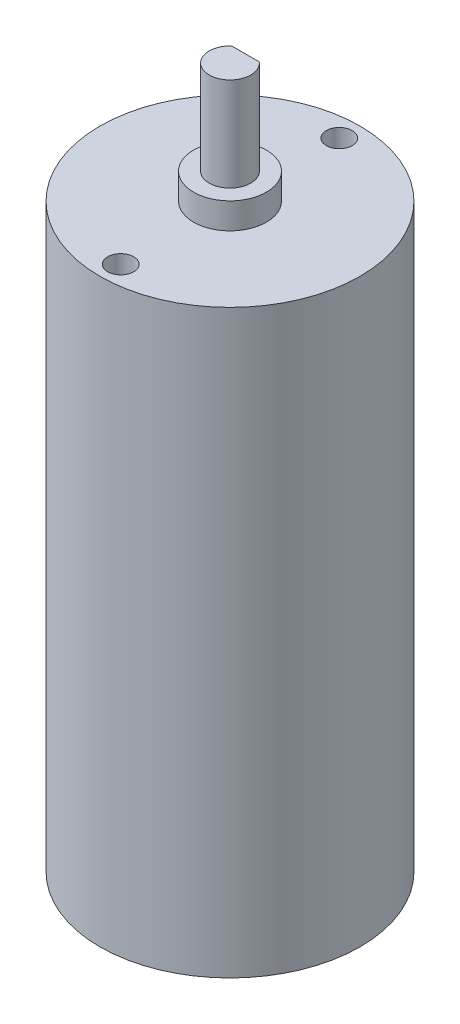
ISO-10303-21;
HEADER;
FILE_DESCRIPTION(('STEP AP214'),'2;1');
FILE_NAME('part.step','',(''),(''),'','','');
FILE_SCHEMA(('AUTOMOTIVE_DESIGN { 1 0 10303 214 1 1 1 1 }'));
ENDSEC;
DATA;
#1=APPLICATION_CONTEXT('core data for automotive mechanical design processes');
#2=APPLICATION_PROTOCOL_DEFINITION('international standard','automotive_design',2000,#1);
#3=PRODUCT_CONTEXT('',#1,'mechanical');
#4=PRODUCT('Part','Part','',(#3));
#5=PRODUCT_RELATED_PRODUCT_CATEGORY('part','',(#4));
#6=PRODUCT_DEFINITION_FORMATION('','',#4);
#7=PRODUCT_DEFINITION_CONTEXT('part definition',#1,'design');
#8=PRODUCT_DEFINITION('design','',#6,#7);
#9=PRODUCT_DEFINITION_SHAPE('','',#8);
#10=(LENGTH_UNIT() NAMED_UNIT(*) SI_UNIT(.MILLI.,.METRE.));
#11=(NAMED_UNIT(*) PLANE_ANGLE_UNIT() SI_UNIT($,.RADIAN.));
#12=(NAMED_UNIT(*) SI_UNIT($,.STERADIAN.) SOLID_ANGLE_UNIT());
#13=UNCERTAINTY_MEASURE_WITH_UNIT(LENGTH_MEASURE(1.E-05),#10,'distance_accuracy_value','');
#14=(GEOMETRIC_REPRESENTATION_CONTEXT(3) GLOBAL_UNCERTAINTY_ASSIGNED_CONTEXT((#13)) GLOBAL_UNIT_ASSIGNED_CONTEXT((#10,
#11,#12)) REPRESENTATION_CONTEXT('',''));
#15=CARTESIAN_POINT('',(0.,0.,0.));
#16=DIRECTION('',(0.,0.,1.));
#17=DIRECTION('',(1.,0.,0.));
#18=AXIS2_PLACEMENT_3D('',#15,#16,#17);
#19=CARTESIAN_POINT('',(0.,58.3,0.));
#20=DIRECTION('',(0.,1.,0.));
#21=DIRECTION('',(0.,0.,1.));
#22=AXIS2_PLACEMENT_3D('',#19,#20,#21);
#23=PLANE('',#22);
#24=CARTESIAN_POINT('',(0.,58.3,0.));
#25=DIRECTION('',(0.,1.,0.));
#26=DIRECTION('',(0.,0.,1.));
#27=AXIS2_PLACEMENT_3D('',#24,#25,#26);
#28=CIRCLE('',#27,3.5);
#29=CARTESIAN_POINT('',(0.,58.3,3.5));
#30=VERTEX_POINT('',#29);
#31=EDGE_CURVE('E93',#30,#30,#28,.T.);
#32=ORIENTED_EDGE('',*,*,#31,.T.);
#33=EDGE_LOOP('',(#32));
#34=FACE_BOUND('',#33,.T.);
#35=CARTESIAN_POINT('',(0.,58.3,0.));
#36=DIRECTION('',(0.,1.,0.));
#37=DIRECTION('',(0.,0.,1.));
#38=AXIS2_PLACEMENT_3D('',#35,#36,#37);
#39=CIRCLE('',#38,2.);
#40=CARTESIAN_POINT('',(-1.3228756555323,58.3,-1.5));
#41=VERTEX_POINT('',#40);
#42=CARTESIAN_POINT('',(1.3228756555323,58.3,-1.5));
#43=VERTEX_POINT('',#42);
#44=EDGE_CURVE('E56',#41,#43,#39,.T.);
#45=ORIENTED_EDGE('',*,*,#44,.F.);
#46=DIRECTION('',(1.,0.,0.));
#47=VECTOR('',#46,1.);
#48=CARTESIAN_POINT('',(0.,58.3,-1.5));
#49=LINE('',#48,#47);
#50=EDGE_CURVE('E70',#41,#43,#49,.T.);
#51=ORIENTED_EDGE('',*,*,#50,.T.);
#52=EDGE_LOOP('',(#45,#51));
#53=FACE_BOUND('',#52,.T.);
#54=ADVANCED_FACE('F41',(#34,#53),#23,.T.);
#55=CARTESIAN_POINT('',(0.,55.8,0.));
#56=DIRECTION('',(0.,-1.,0.));
#57=DIRECTION('',(0.,0.,-1.));
#58=AXIS2_PLACEMENT_3D('',#55,#56,#57);
#59=CYLINDRICAL_SURFACE('',#58,12.5);
#60=CARTESIAN_POINT('',(0.,55.8,0.));
#61=DIRECTION('',(0.,1.,0.));
#62=DIRECTION('',(0.,0.,1.));
#63=AXIS2_PLACEMENT_3D('',#60,#61,#62);
#64=CIRCLE('',#63,12.5);
#65=CARTESIAN_POINT('',(0.,55.8,12.5));
#66=VERTEX_POINT('',#65);
#67=EDGE_CURVE('E11',#66,#66,#64,.T.);
#68=ORIENTED_EDGE('',*,*,#67,.F.);
#69=EDGE_LOOP('',(#68));
#70=FACE_BOUND('',#69,.T.);
#71=CARTESIAN_POINT('',(0.,0.,0.));
#72=DIRECTION('',(0.,1.,0.));
#73=DIRECTION('',(0.,0.,1.));
#74=AXIS2_PLACEMENT_3D('',#71,#72,#73);
#75=CIRCLE('',#74,12.5);
#76=CARTESIAN_POINT('',(0.,0.,12.5));
#77=VERTEX_POINT('',#76);
#78=EDGE_CURVE('E45',#77,#77,#75,.T.);
#79=ORIENTED_EDGE('',*,*,#78,.T.);
#80=EDGE_LOOP('',(#79));
#81=FACE_BOUND('',#80,.T.);
#82=ADVANCED_FACE('F43',(#70,#81),#59,.T.);
#83=CARTESIAN_POINT('',(0.,55.8,0.));
#84=DIRECTION('',(0.,1.,0.));
#85=DIRECTION('',(0.,0.,1.));
#86=AXIS2_PLACEMENT_3D('',#83,#84,#85);
#87=PLANE('',#86);
#88=CARTESIAN_POINT('',(0.,55.8,0.));
#89=DIRECTION('',(0.,1.,0.));
#90=DIRECTION('',(0.,0.,1.));
#91=AXIS2_PLACEMENT_3D('',#88,#89,#90);
#92=CIRCLE('',#91,3.5);
#93=CARTESIAN_POINT('',(0.,55.8,3.5));
#94=VERTEX_POINT('',#93);
#95=EDGE_CURVE('E92',#94,#94,#92,.T.);
#96=ORIENTED_EDGE('',*,*,#95,.F.);
#97=EDGE_LOOP('',(#96));
#98=FACE_BOUND('',#97,.T.);
#99=CARTESIAN_POINT('',(0.,55.8,-10.5));
#100=DIRECTION('',(0.,1.,0.));
#101=DIRECTION('',(0.,0.,1.));
#102=AXIS2_PLACEMENT_3D('',#99,#100,#101);
#103=CIRCLE('',#102,1.25);
#104=CARTESIAN_POINT('',(0.,55.8,-9.25));
#105=VERTEX_POINT('',#104);
#106=EDGE_CURVE('E105',#105,#105,#103,.T.);
#107=ORIENTED_EDGE('',*,*,#106,.F.);
#108=EDGE_LOOP('',(#107));
#109=FACE_BOUND('',#108,.T.);
#110=CARTESIAN_POINT('',(0.,55.8,10.5));
#111=DIRECTION('',(0.,1.,0.));
#112=DIRECTION('',(0.,0.,1.));
#113=AXIS2_PLACEMENT_3D('',#110,#111,#112);
#114=CIRCLE('',#113,1.25);
#115=CARTESIAN_POINT('',(0.,55.8,11.75));
#116=VERTEX_POINT('',#115);
#117=EDGE_CURVE('E109',#116,#116,#114,.T.);
#118=ORIENTED_EDGE('',*,*,#117,.F.);
#119=EDGE_LOOP('',(#118));
#120=FACE_BOUND('',#119,.T.);
#121=ORIENTED_EDGE('',*,*,#67,.T.);
#122=EDGE_LOOP('',(#121));
#123=FACE_BOUND('',#122,.T.);
#124=ADVANCED_FACE('F126',(#98,#109,#120,#123),#87,.T.);
#125=CARTESIAN_POINT('',(0.,0.,0.));
#126=DIRECTION('',(0.,1.,0.));
#127=DIRECTION('',(0.,0.,1.));
#128=AXIS2_PLACEMENT_3D('',#125,#126,#127);
#129=PLANE('',#128);
#130=ORIENTED_EDGE('',*,*,#78,.F.);
#131=EDGE_LOOP('',(#130));
#132=FACE_BOUND('',#131,.T.);
#133=ADVANCED_FACE('F122',(#132),#129,.F.);
#134=CARTESIAN_POINT('',(0.,50.8,10.5));
#135=DIRECTION('',(0.,1.,0.));
#136=DIRECTION('',(0.,0.,1.));
#137=AXIS2_PLACEMENT_3D('',#134,#135,#136);
#138=CYLINDRICAL_SURFACE('',#137,1.25);
#139=CARTESIAN_POINT('',(0.,50.8,10.5));
#140=DIRECTION('',(0.,1.,0.));
#141=DIRECTION('',(0.,0.,1.));
#142=AXIS2_PLACEMENT_3D('',#139,#140,#141);
#143=CIRCLE('',#142,1.25);
#144=CARTESIAN_POINT('',(0.,50.8,11.75));
#145=VERTEX_POINT('',#144);
#146=EDGE_CURVE('E97',#145,#145,#143,.T.);
#147=ORIENTED_EDGE('',*,*,#146,.F.);
#148=EDGE_LOOP('',(#147));
#149=FACE_BOUND('',#148,.T.);
#150=ORIENTED_EDGE('',*,*,#117,.T.);
#151=EDGE_LOOP('',(#150));
#152=FACE_BOUND('',#151,.T.);
#153=ADVANCED_FACE('F119',(#149,#152),#138,.F.);
#154=CARTESIAN_POINT('',(0.,50.8,10.5));
#155=DIRECTION('',(0.,1.,0.));
#156=DIRECTION('',(0.,0.,1.));
#157=AXIS2_PLACEMENT_3D('',#154,#155,#156);
#158=PLANE('',#157);
#159=ORIENTED_EDGE('',*,*,#146,.T.);
#160=EDGE_LOOP('',(#159));
#161=FACE_BOUND('',#160,.T.);
#162=ADVANCED_FACE('F117',(#161),#158,.T.);
#163=CARTESIAN_POINT('',(0.,50.8,-10.5));
#164=DIRECTION('',(0.,1.,0.));
#165=DIRECTION('',(0.,0.,1.));
#166=AXIS2_PLACEMENT_3D('',#163,#164,#165);
#167=CYLINDRICAL_SURFACE('',#166,1.25);
#168=CARTESIAN_POINT('',(0.,50.8,-10.5));
#169=DIRECTION('',(0.,1.,0.));
#170=DIRECTION('',(0.,0.,1.));
#171=AXIS2_PLACEMENT_3D('',#168,#169,#170);
#172=CIRCLE('',#171,1.25);
#173=CARTESIAN_POINT('',(0.,50.8,-9.25));
#174=VERTEX_POINT('',#173);
#175=EDGE_CURVE('E101',#174,#174,#172,.T.);
#176=ORIENTED_EDGE('',*,*,#175,.F.);
#177=EDGE_LOOP('',(#176));
#178=FACE_BOUND('',#177,.T.);
#179=ORIENTED_EDGE('',*,*,#106,.T.);
#180=EDGE_LOOP('',(#179));
#181=FACE_BOUND('',#180,.T.);
#182=ADVANCED_FACE('F157',(#178,#181),#167,.F.);
#183=CARTESIAN_POINT('',(0.,50.8,0.));
#184=DIRECTION('',(0.,1.,0.));
#185=DIRECTION('',(0.,0.,1.));
#186=AXIS2_PLACEMENT_3D('',#183,#184,#185);
#187=PLANE('',#186);
#188=ORIENTED_EDGE('',*,*,#175,.T.);
#189=EDGE_LOOP('',(#188));
#190=FACE_BOUND('',#189,.T.);
#191=ADVANCED_FACE('F153',(#190),#187,.T.);
#192=CARTESIAN_POINT('',(0.,58.3,0.));
#193=DIRECTION('',(0.,-1.,0.));
#194=DIRECTION('',(0.,0.,-1.));
#195=AXIS2_PLACEMENT_3D('',#192,#193,#194);
#196=CYLINDRICAL_SURFACE('',#195,3.5);
#197=ORIENTED_EDGE('',*,*,#31,.F.);
#198=EDGE_LOOP('',(#197));
#199=FACE_BOUND('',#198,.T.);
#200=ORIENTED_EDGE('',*,*,#95,.T.);
#201=EDGE_LOOP('',(#200));
#202=FACE_BOUND('',#201,.T.);
#203=ADVANCED_FACE('F150',(#199,#202),#196,.T.);
#204=CARTESIAN_POINT('',(0.,67.3,-1.5));
#205=DIRECTION('',(0.,0.,-1.));
#206=DIRECTION('',(-1.,0.,0.));
#207=AXIS2_PLACEMENT_3D('',#204,#205,#206);
#208=PLANE('',#207);
#209=ORIENTED_EDGE('',*,*,#50,.F.);
#210=DIRECTION('',(0.,-1.,0.));
#211=VECTOR('',#210,1.);
#212=CARTESIAN_POINT('',(-1.3228756555323,67.3,-1.5));
#213=LINE('',#212,#211);
#214=CARTESIAN_POINT('',(-1.3228756555323,67.3,-1.5));
#215=VERTEX_POINT('',#214);
#216=EDGE_CURVE('E81',#215,#41,#213,.T.);
#217=ORIENTED_EDGE('',*,*,#216,.F.);
#218=DIRECTION('',(1.,0.,0.));
#219=VECTOR('',#218,1.);
#220=CARTESIAN_POINT('',(0.,67.3,-1.5));
#221=LINE('',#220,#219);
#222=CARTESIAN_POINT('',(1.3228756555323,67.3,-1.5));
#223=VERTEX_POINT('',#222);
#224=EDGE_CURVE('E78',#215,#223,#221,.T.);
#225=ORIENTED_EDGE('',*,*,#224,.T.);
#226=DIRECTION('',(0.,-1.,0.));
#227=VECTOR('',#226,1.);
#228=CARTESIAN_POINT('',(1.3228756555323,67.3,-1.5));
#229=LINE('',#228,#227);
#230=EDGE_CURVE('E76',#223,#43,#229,.T.);
#231=ORIENTED_EDGE('',*,*,#230,.T.);
#232=EDGE_LOOP('',(#209,#217,#225,#231));
#233=FACE_BOUND('',#232,.T.);
#234=ADVANCED_FACE('F77',(#233),#208,.T.);
#235=CARTESIAN_POINT('',(0.,67.3,0.));
#236=DIRECTION('',(0.,-1.,0.));
#237=DIRECTION('',(0.,0.,-1.));
#238=AXIS2_PLACEMENT_3D('',#235,#236,#237);
#239=CYLINDRICAL_SURFACE('',#238,2.);
#240=ORIENTED_EDGE('',*,*,#44,.T.);
#241=ORIENTED_EDGE('',*,*,#230,.F.);
#242=CARTESIAN_POINT('',(0.,67.3,0.));
#243=DIRECTION('',(0.,1.,0.));
#244=DIRECTION('',(0.,0.,1.));
#245=AXIS2_PLACEMENT_3D('',#242,#243,#244);
#246=CIRCLE('',#245,2.);
#247=EDGE_CURVE('E64',#215,#223,#246,.T.);
#248=ORIENTED_EDGE('',*,*,#247,.F.);
#249=ORIENTED_EDGE('',*,*,#216,.T.);
#250=EDGE_LOOP('',(#240,#241,#248,#249));
#251=FACE_BOUND('',#250,.T.);
#252=ADVANCED_FACE('F83',(#251),#239,.T.);
#253=CARTESIAN_POINT('',(0.,67.3,0.));
#254=DIRECTION('',(0.,1.,0.));
#255=DIRECTION('',(0.,0.,1.));
#256=AXIS2_PLACEMENT_3D('',#253,#254,#255);
#257=PLANE('',#256);
#258=ORIENTED_EDGE('',*,*,#224,.F.);
#259=ORIENTED_EDGE('',*,*,#247,.T.);
#260=EDGE_LOOP('',(#258,#259));
#261=FACE_BOUND('',#260,.T.);
#262=ADVANCED_FACE('F191',(#261),#257,.T.);
#263=CLOSED_SHELL('',(#54,#82,#124,#133,#153,#162,#182,#191,#203,#234,#252,#262));
#264=MANIFOLD_SOLID_BREP('B2',#263);
#265=ADVANCED_BREP_SHAPE_REPRESENTATION('',(#18,#264),#14);
#266=SHAPE_DEFINITION_REPRESENTATION(#9,#265);
ENDSEC;
END-ISO-10303-21;
